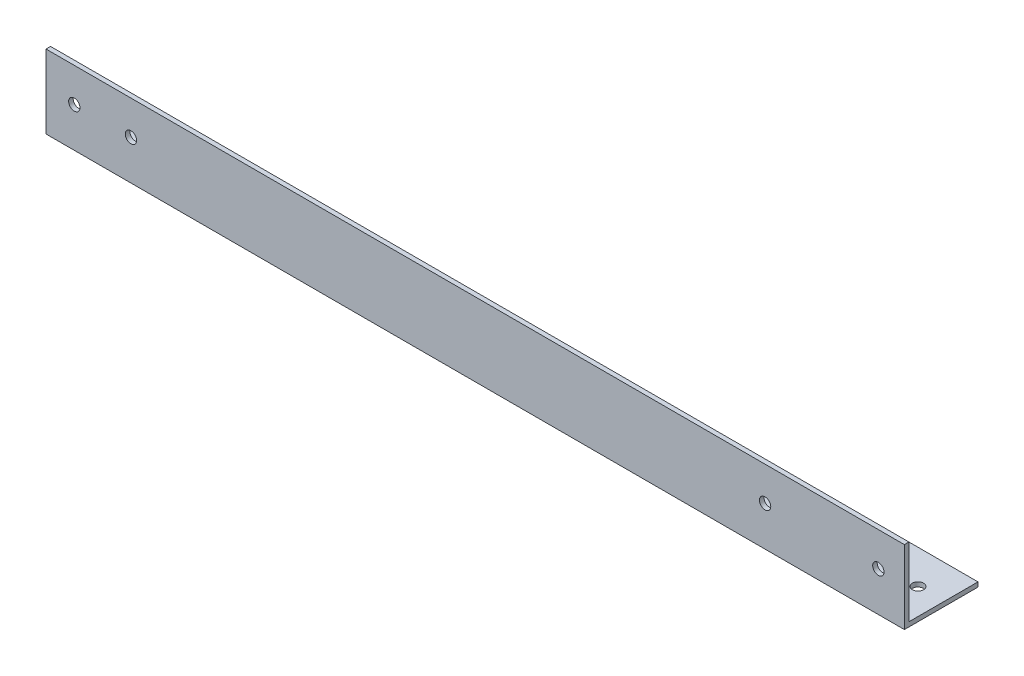
ISO-10303-21;
HEADER;
FILE_DESCRIPTION(('STEP AP214'),'2;1');
FILE_NAME('part.step','',(''),(''),'','','');
FILE_SCHEMA(('AUTOMOTIVE_DESIGN { 1 0 10303 214 1 1 1 1 }'));
ENDSEC;
DATA;
#1=APPLICATION_CONTEXT('core data for automotive mechanical design processes');
#2=APPLICATION_PROTOCOL_DEFINITION('international standard','automotive_design',2000,#1);
#3=PRODUCT_CONTEXT('',#1,'mechanical');
#4=PRODUCT('Part','Part','',(#3));
#5=PRODUCT_RELATED_PRODUCT_CATEGORY('part','',(#4));
#6=PRODUCT_DEFINITION_FORMATION('','',#4);
#7=PRODUCT_DEFINITION_CONTEXT('part definition',#1,'design');
#8=PRODUCT_DEFINITION('design','',#6,#7);
#9=PRODUCT_DEFINITION_SHAPE('','',#8);
#10=(LENGTH_UNIT() NAMED_UNIT(*) SI_UNIT(.MILLI.,.METRE.));
#11=(NAMED_UNIT(*) PLANE_ANGLE_UNIT() SI_UNIT($,.RADIAN.));
#12=(NAMED_UNIT(*) SI_UNIT($,.STERADIAN.) SOLID_ANGLE_UNIT());
#13=UNCERTAINTY_MEASURE_WITH_UNIT(LENGTH_MEASURE(1.E-05),#10,'distance_accuracy_value','');
#14=(GEOMETRIC_REPRESENTATION_CONTEXT(3) GLOBAL_UNCERTAINTY_ASSIGNED_CONTEXT((#13)) GLOBAL_UNIT_ASSIGNED_CONTEXT((#10,
#11,#12)) REPRESENTATION_CONTEXT('',''));
#15=CARTESIAN_POINT('',(0.,0.,0.));
#16=DIRECTION('',(0.,0.,1.));
#17=DIRECTION('',(1.,0.,0.));
#18=AXIS2_PLACEMENT_3D('',#15,#16,#17);
#19=CARTESIAN_POINT('',(758.,0.,0.));
#20=DIRECTION('',(0.,1.,0.));
#21=DIRECTION('',(0.,0.,1.));
#22=AXIS2_PLACEMENT_3D('',#19,#20,#21);
#23=PLANE('',#22);
#24=CARTESIAN_POINT('',(75.,0.,-35.));
#25=DIRECTION('',(0.,-1.,0.));
#26=DIRECTION('',(0.,0.,-1.));
#27=AXIS2_PLACEMENT_3D('',#24,#25,#26);
#28=CIRCLE('',#27,4.99999999999999);
#29=CARTESIAN_POINT('',(75.,0.,-40.));
#30=VERTEX_POINT('',#29);
#31=EDGE_CURVE('E143',#30,#30,#28,.T.);
#32=ORIENTED_EDGE('',*,*,#31,.F.);
#33=EDGE_LOOP('',(#32));
#34=FACE_BOUND('',#33,.T.);
#35=CARTESIAN_POINT('',(735.,0.,-35.));
#36=DIRECTION('',(0.,-1.,0.));
#37=DIRECTION('',(0.,0.,1.));
#38=AXIS2_PLACEMENT_3D('',#35,#36,#37);
#39=CIRCLE('',#38,5.00000000000005);
#40=CARTESIAN_POINT('',(735.,0.,-30.));
#41=VERTEX_POINT('',#40);
#42=EDGE_CURVE('E217',#41,#41,#39,.T.);
#43=ORIENTED_EDGE('',*,*,#42,.F.);
#44=EDGE_LOOP('',(#43));
#45=FACE_BOUND('',#44,.T.);
#46=CARTESIAN_POINT('',(635.,0.,-35.));
#47=DIRECTION('',(0.,-1.,0.));
#48=DIRECTION('',(0.,0.,1.));
#49=AXIS2_PLACEMENT_3D('',#46,#47,#48);
#50=CIRCLE('',#49,5.00000000000005);
#51=CARTESIAN_POINT('',(635.,0.,-30.));
#52=VERTEX_POINT('',#51);
#53=EDGE_CURVE('E156',#52,#52,#50,.T.);
#54=ORIENTED_EDGE('',*,*,#53,.F.);
#55=EDGE_LOOP('',(#54));
#56=FACE_BOUND('',#55,.T.);
#57=CARTESIAN_POINT('',(25.,0.,-35.));
#58=DIRECTION('',(0.,-1.,0.));
#59=DIRECTION('',(0.,0.,-1.));
#60=AXIS2_PLACEMENT_3D('',#57,#58,#59);
#61=CIRCLE('',#60,5.);
#62=CARTESIAN_POINT('',(25.,0.,-40.));
#63=VERTEX_POINT('',#62);
#64=EDGE_CURVE('E139',#63,#63,#61,.T.);
#65=ORIENTED_EDGE('',*,*,#64,.F.);
#66=EDGE_LOOP('',(#65));
#67=FACE_BOUND('',#66,.T.);
#68=DIRECTION('',(0.,0.,-1.));
#69=VECTOR('',#68,1.);
#70=CARTESIAN_POINT('',(0.,0.,0.));
#71=LINE('',#70,#69);
#72=CARTESIAN_POINT('',(0.,0.,0.));
#73=VERTEX_POINT('',#72);
#74=CARTESIAN_POINT('',(0.,0.,-65.));
#75=VERTEX_POINT('',#74);
#76=EDGE_CURVE('E117',#73,#75,#71,.T.);
#77=ORIENTED_EDGE('',*,*,#76,.T.);
#78=DIRECTION('',(-1.,0.,0.));
#79=VECTOR('',#78,1.);
#80=CARTESIAN_POINT('',(758.,0.,-65.));
#81=LINE('',#80,#79);
#82=CARTESIAN_POINT('',(758.,0.,-65.));
#83=VERTEX_POINT('',#82);
#84=EDGE_CURVE('E11',#83,#75,#81,.T.);
#85=ORIENTED_EDGE('',*,*,#84,.F.);
#86=DIRECTION('',(0.,0.,-1.));
#87=VECTOR('',#86,1.);
#88=CARTESIAN_POINT('',(758.,0.,0.));
#89=LINE('',#88,#87);
#90=CARTESIAN_POINT('',(758.,0.,0.));
#91=VERTEX_POINT('',#90);
#92=EDGE_CURVE('E82',#91,#83,#89,.T.);
#93=ORIENTED_EDGE('',*,*,#92,.F.);
#94=DIRECTION('',(-1.,0.,0.));
#95=VECTOR('',#94,1.);
#96=CARTESIAN_POINT('',(758.,0.,0.));
#97=LINE('',#96,#95);
#98=EDGE_CURVE('E113',#91,#73,#97,.T.);
#99=ORIENTED_EDGE('',*,*,#98,.T.);
#100=EDGE_LOOP('',(#77,#85,#93,#99));
#101=FACE_BOUND('',#100,.T.);
#102=ADVANCED_FACE('F34',(#34,#45,#56,#67,#101),#23,.F.);
#103=CARTESIAN_POINT('',(758.,4.,-65.));
#104=DIRECTION('',(0.,0.,-1.));
#105=DIRECTION('',(-1.,0.,0.));
#106=AXIS2_PLACEMENT_3D('',#103,#104,#105);
#107=PLANE('',#106);
#108=DIRECTION('',(0.,-1.,0.));
#109=VECTOR('',#108,1.);
#110=CARTESIAN_POINT('',(0.,4.,-65.));
#111=LINE('',#110,#109);
#112=CARTESIAN_POINT('',(0.,4.,-65.));
#113=VERTEX_POINT('',#112);
#114=EDGE_CURVE('E120',#113,#75,#111,.T.);
#115=ORIENTED_EDGE('',*,*,#114,.F.);
#116=DIRECTION('',(-1.,0.,0.));
#117=VECTOR('',#116,1.);
#118=CARTESIAN_POINT('',(758.,4.,-65.));
#119=LINE('',#118,#117);
#120=CARTESIAN_POINT('',(758.,4.,-65.));
#121=VERTEX_POINT('',#120);
#122=EDGE_CURVE('E43',#121,#113,#119,.T.);
#123=ORIENTED_EDGE('',*,*,#122,.F.);
#124=DIRECTION('',(0.,-1.,0.));
#125=VECTOR('',#124,1.);
#126=CARTESIAN_POINT('',(758.,4.,-65.));
#127=LINE('',#126,#125);
#128=EDGE_CURVE('E181',#121,#83,#127,.T.);
#129=ORIENTED_EDGE('',*,*,#128,.T.);
#130=ORIENTED_EDGE('',*,*,#84,.T.);
#131=EDGE_LOOP('',(#115,#123,#129,#130));
#132=FACE_BOUND('',#131,.T.);
#133=ADVANCED_FACE('F205',(#132),#107,.T.);
#134=CARTESIAN_POINT('',(758.,4.,0.));
#135=DIRECTION('',(0.,1.,0.));
#136=DIRECTION('',(0.,0.,1.));
#137=AXIS2_PLACEMENT_3D('',#134,#135,#136);
#138=PLANE('',#137);
#139=CARTESIAN_POINT('',(75.,4.,-35.));
#140=DIRECTION('',(0.,1.,0.));
#141=DIRECTION('',(0.,0.,1.));
#142=AXIS2_PLACEMENT_3D('',#139,#140,#141);
#143=CIRCLE('',#142,4.99999999999999);
#144=CARTESIAN_POINT('',(75.,4.,-30.));
#145=VERTEX_POINT('',#144);
#146=EDGE_CURVE('E37',#145,#145,#143,.T.);
#147=ORIENTED_EDGE('',*,*,#146,.F.);
#148=EDGE_LOOP('',(#147));
#149=FACE_BOUND('',#148,.T.);
#150=CARTESIAN_POINT('',(735.,4.,-35.));
#151=DIRECTION('',(0.,1.,0.));
#152=DIRECTION('',(0.,0.,1.));
#153=AXIS2_PLACEMENT_3D('',#150,#151,#152);
#154=CIRCLE('',#153,5.00000000000005);
#155=CARTESIAN_POINT('',(735.,4.,-30.));
#156=VERTEX_POINT('',#155);
#157=EDGE_CURVE('E142',#156,#156,#154,.T.);
#158=ORIENTED_EDGE('',*,*,#157,.F.);
#159=EDGE_LOOP('',(#158));
#160=FACE_BOUND('',#159,.T.);
#161=CARTESIAN_POINT('',(635.,4.,-35.));
#162=DIRECTION('',(0.,1.,0.));
#163=DIRECTION('',(0.,0.,1.));
#164=AXIS2_PLACEMENT_3D('',#161,#162,#163);
#165=CIRCLE('',#164,5.00000000000005);
#166=CARTESIAN_POINT('',(635.,4.,-30.));
#167=VERTEX_POINT('',#166);
#168=EDGE_CURVE('E140',#167,#167,#165,.T.);
#169=ORIENTED_EDGE('',*,*,#168,.F.);
#170=EDGE_LOOP('',(#169));
#171=FACE_BOUND('',#170,.T.);
#172=CARTESIAN_POINT('',(25.,4.,-35.));
#173=DIRECTION('',(0.,1.,0.));
#174=DIRECTION('',(0.,0.,1.));
#175=AXIS2_PLACEMENT_3D('',#172,#173,#174);
#176=CIRCLE('',#175,5.);
#177=CARTESIAN_POINT('',(25.,4.,-30.));
#178=VERTEX_POINT('',#177);
#179=EDGE_CURVE('E135',#178,#178,#176,.T.);
#180=ORIENTED_EDGE('',*,*,#179,.F.);
#181=EDGE_LOOP('',(#180));
#182=FACE_BOUND('',#181,.T.);
#183=DIRECTION('',(0.,0.,-1.));
#184=VECTOR('',#183,1.);
#185=CARTESIAN_POINT('',(0.,4.,0.));
#186=LINE('',#185,#184);
#187=CARTESIAN_POINT('',(0.,4.,-4.));
#188=VERTEX_POINT('',#187);
#189=EDGE_CURVE('E124',#188,#113,#186,.T.);
#190=ORIENTED_EDGE('',*,*,#189,.F.);
#191=DIRECTION('',(-1.,0.,0.));
#192=VECTOR('',#191,1.);
#193=CARTESIAN_POINT('',(758.,4.,-4.));
#194=LINE('',#193,#192);
#195=CARTESIAN_POINT('',(758.,4.,-4.));
#196=VERTEX_POINT('',#195);
#197=EDGE_CURVE('E103',#196,#188,#194,.T.);
#198=ORIENTED_EDGE('',*,*,#197,.F.);
#199=DIRECTION('',(0.,0.,-1.));
#200=VECTOR('',#199,1.);
#201=CARTESIAN_POINT('',(758.,4.,0.));
#202=LINE('',#201,#200);
#203=EDGE_CURVE('E109',#196,#121,#202,.T.);
#204=ORIENTED_EDGE('',*,*,#203,.T.);
#205=ORIENTED_EDGE('',*,*,#122,.T.);
#206=EDGE_LOOP('',(#190,#198,#204,#205));
#207=FACE_BOUND('',#206,.T.);
#208=ADVANCED_FACE('F185',(#149,#160,#171,#182,#207),#138,.T.);
#209=CARTESIAN_POINT('',(758.,0.,-4.));
#210=DIRECTION('',(0.,0.,-1.));
#211=DIRECTION('',(-1.,0.,0.));
#212=AXIS2_PLACEMENT_3D('',#209,#210,#211);
#213=PLANE('',#212);
#214=CARTESIAN_POINT('',(75.,35.,-4.));
#215=DIRECTION('',(0.,0.,-1.));
#216=DIRECTION('',(-1.,0.,0.));
#217=AXIS2_PLACEMENT_3D('',#214,#215,#216);
#218=CIRCLE('',#217,5.00000000000001);
#219=CARTESIAN_POINT('',(70.,35.,-4.));
#220=VERTEX_POINT('',#219);
#221=EDGE_CURVE('E172',#220,#220,#218,.T.);
#222=ORIENTED_EDGE('',*,*,#221,.F.);
#223=EDGE_LOOP('',(#222));
#224=FACE_BOUND('',#223,.T.);
#225=CARTESIAN_POINT('',(735.,35.,-4.));
#226=DIRECTION('',(0.,0.,-1.));
#227=DIRECTION('',(-1.,0.,0.));
#228=AXIS2_PLACEMENT_3D('',#225,#226,#227);
#229=CIRCLE('',#228,5.00000000000005);
#230=CARTESIAN_POINT('',(730.,35.,-4.));
#231=VERTEX_POINT('',#230);
#232=EDGE_CURVE('E169',#231,#231,#229,.T.);
#233=ORIENTED_EDGE('',*,*,#232,.F.);
#234=EDGE_LOOP('',(#233));
#235=FACE_BOUND('',#234,.T.);
#236=CARTESIAN_POINT('',(635.,35.,-4.));
#237=DIRECTION('',(0.,0.,-1.));
#238=DIRECTION('',(-1.,0.,0.));
#239=AXIS2_PLACEMENT_3D('',#236,#237,#238);
#240=CIRCLE('',#239,5.00000000000005);
#241=CARTESIAN_POINT('',(630.,35.,-4.));
#242=VERTEX_POINT('',#241);
#243=EDGE_CURVE('E161',#242,#242,#240,.T.);
#244=ORIENTED_EDGE('',*,*,#243,.F.);
#245=EDGE_LOOP('',(#244));
#246=FACE_BOUND('',#245,.T.);
#247=CARTESIAN_POINT('',(25.,35.,-4.));
#248=DIRECTION('',(0.,0.,-1.));
#249=DIRECTION('',(-1.,0.,0.));
#250=AXIS2_PLACEMENT_3D('',#247,#248,#249);
#251=CIRCLE('',#250,5.);
#252=CARTESIAN_POINT('',(20.,35.,-4.));
#253=VERTEX_POINT('',#252);
#254=EDGE_CURVE('E121',#253,#253,#251,.T.);
#255=ORIENTED_EDGE('',*,*,#254,.F.);
#256=EDGE_LOOP('',(#255));
#257=FACE_BOUND('',#256,.T.);
#258=DIRECTION('',(0.,1.,0.));
#259=VECTOR('',#258,1.);
#260=CARTESIAN_POINT('',(0.,0.,-4.));
#261=LINE('',#260,#259);
#262=CARTESIAN_POINT('',(0.,65.,-4.));
#263=VERTEX_POINT('',#262);
#264=EDGE_CURVE('E98',#263,#188,#261,.F.);
#265=ORIENTED_EDGE('',*,*,#264,.F.);
#266=DIRECTION('',(-1.,0.,0.));
#267=VECTOR('',#266,1.);
#268=CARTESIAN_POINT('',(758.,65.,-4.));
#269=LINE('',#268,#267);
#270=CARTESIAN_POINT('',(758.,65.,-4.));
#271=VERTEX_POINT('',#270);
#272=EDGE_CURVE('E93',#271,#263,#269,.T.);
#273=ORIENTED_EDGE('',*,*,#272,.F.);
#274=DIRECTION('',(0.,1.,0.));
#275=VECTOR('',#274,1.);
#276=CARTESIAN_POINT('',(758.,0.,-4.));
#277=LINE('',#276,#275);
#278=EDGE_CURVE('E96',#271,#196,#277,.F.);
#279=ORIENTED_EDGE('',*,*,#278,.T.);
#280=ORIENTED_EDGE('',*,*,#197,.T.);
#281=EDGE_LOOP('',(#265,#273,#279,#280));
#282=FACE_BOUND('',#281,.T.);
#283=ADVANCED_FACE('F95',(#224,#235,#246,#257,#282),#213,.T.);
#284=CARTESIAN_POINT('',(758.,65.,0.));
#285=DIRECTION('',(0.,1.,0.));
#286=DIRECTION('',(0.,0.,1.));
#287=AXIS2_PLACEMENT_3D('',#284,#285,#286);
#288=PLANE('',#287);
#289=DIRECTION('',(0.,0.,-1.));
#290=VECTOR('',#289,1.);
#291=CARTESIAN_POINT('',(0.,65.,0.));
#292=LINE('',#291,#290);
#293=CARTESIAN_POINT('',(0.,65.,0.));
#294=VERTEX_POINT('',#293);
#295=EDGE_CURVE('E128',#294,#263,#292,.T.);
#296=ORIENTED_EDGE('',*,*,#295,.F.);
#297=DIRECTION('',(-1.,0.,0.));
#298=VECTOR('',#297,1.);
#299=CARTESIAN_POINT('',(758.,65.,0.));
#300=LINE('',#299,#298);
#301=CARTESIAN_POINT('',(758.,65.,0.));
#302=VERTEX_POINT('',#301);
#303=EDGE_CURVE('E73',#302,#294,#300,.T.);
#304=ORIENTED_EDGE('',*,*,#303,.F.);
#305=DIRECTION('',(0.,0.,-1.));
#306=VECTOR('',#305,1.);
#307=CARTESIAN_POINT('',(758.,65.,0.));
#308=LINE('',#307,#306);
#309=EDGE_CURVE('E107',#302,#271,#308,.T.);
#310=ORIENTED_EDGE('',*,*,#309,.T.);
#311=ORIENTED_EDGE('',*,*,#272,.T.);
#312=EDGE_LOOP('',(#296,#304,#310,#311));
#313=FACE_BOUND('',#312,.T.);
#314=ADVANCED_FACE('F111',(#313),#288,.T.);
#315=CARTESIAN_POINT('',(758.,0.,0.));
#316=DIRECTION('',(0.,0.,-1.));
#317=DIRECTION('',(-1.,0.,0.));
#318=AXIS2_PLACEMENT_3D('',#315,#316,#317);
#319=PLANE('',#318);
#320=CARTESIAN_POINT('',(75.,35.,0.));
#321=DIRECTION('',(0.,0.,1.));
#322=DIRECTION('',(1.,0.,0.));
#323=AXIS2_PLACEMENT_3D('',#320,#321,#322);
#324=CIRCLE('',#323,5.00000000000001);
#325=CARTESIAN_POINT('',(80.,35.,0.));
#326=VERTEX_POINT('',#325);
#327=EDGE_CURVE('E158',#326,#326,#324,.T.);
#328=ORIENTED_EDGE('',*,*,#327,.F.);
#329=EDGE_LOOP('',(#328));
#330=FACE_BOUND('',#329,.T.);
#331=CARTESIAN_POINT('',(735.,35.,0.));
#332=DIRECTION('',(0.,0.,1.));
#333=DIRECTION('',(-1.,0.,0.));
#334=AXIS2_PLACEMENT_3D('',#331,#332,#333);
#335=CIRCLE('',#334,5.00000000000005);
#336=CARTESIAN_POINT('',(730.,35.,0.));
#337=VERTEX_POINT('',#336);
#338=EDGE_CURVE('E162',#337,#337,#335,.T.);
#339=ORIENTED_EDGE('',*,*,#338,.F.);
#340=EDGE_LOOP('',(#339));
#341=FACE_BOUND('',#340,.T.);
#342=CARTESIAN_POINT('',(635.,35.,0.));
#343=DIRECTION('',(0.,0.,1.));
#344=DIRECTION('',(-1.,0.,0.));
#345=AXIS2_PLACEMENT_3D('',#342,#343,#344);
#346=CIRCLE('',#345,5.00000000000005);
#347=CARTESIAN_POINT('',(630.,35.,0.));
#348=VERTEX_POINT('',#347);
#349=EDGE_CURVE('E138',#348,#348,#346,.T.);
#350=ORIENTED_EDGE('',*,*,#349,.F.);
#351=EDGE_LOOP('',(#350));
#352=FACE_BOUND('',#351,.T.);
#353=CARTESIAN_POINT('',(25.,35.,0.));
#354=DIRECTION('',(0.,0.,1.));
#355=DIRECTION('',(1.,0.,0.));
#356=AXIS2_PLACEMENT_3D('',#353,#354,#355);
#357=CIRCLE('',#356,5.);
#358=CARTESIAN_POINT('',(30.,35.,0.));
#359=VERTEX_POINT('',#358);
#360=EDGE_CURVE('E175',#359,#359,#357,.T.);
#361=ORIENTED_EDGE('',*,*,#360,.F.);
#362=EDGE_LOOP('',(#361));
#363=FACE_BOUND('',#362,.T.);
#364=DIRECTION('',(0.,-1.,0.));
#365=VECTOR('',#364,1.);
#366=CARTESIAN_POINT('',(0.,0.,0.));
#367=LINE('',#366,#365);
#368=EDGE_CURVE('E76',#294,#73,#367,.T.);
#369=ORIENTED_EDGE('',*,*,#368,.T.);
#370=ORIENTED_EDGE('',*,*,#98,.F.);
#371=DIRECTION('',(0.,-1.,0.));
#372=VECTOR('',#371,1.);
#373=CARTESIAN_POINT('',(758.,0.,0.));
#374=LINE('',#373,#372);
#375=EDGE_CURVE('E52',#302,#91,#374,.T.);
#376=ORIENTED_EDGE('',*,*,#375,.F.);
#377=ORIENTED_EDGE('',*,*,#303,.T.);
#378=EDGE_LOOP('',(#369,#370,#376,#377));
#379=FACE_BOUND('',#378,.T.);
#380=ADVANCED_FACE('F191',(#330,#341,#352,#363,#379),#319,.F.);
#381=CARTESIAN_POINT('',(758.,0.,0.));
#382=DIRECTION('',(-1.,0.,0.));
#383=DIRECTION('',(0.,0.,1.));
#384=AXIS2_PLACEMENT_3D('',#381,#382,#383);
#385=PLANE('',#384);
#386=ORIENTED_EDGE('',*,*,#92,.T.);
#387=ORIENTED_EDGE('',*,*,#128,.F.);
#388=ORIENTED_EDGE('',*,*,#203,.F.);
#389=ORIENTED_EDGE('',*,*,#278,.F.);
#390=ORIENTED_EDGE('',*,*,#309,.F.);
#391=ORIENTED_EDGE('',*,*,#375,.T.);
#392=EDGE_LOOP('',(#386,#387,#388,#389,#390,#391));
#393=FACE_BOUND('',#392,.T.);
#394=ADVANCED_FACE('F106',(#393),#385,.F.);
#395=CARTESIAN_POINT('',(0.,0.,0.));
#396=DIRECTION('',(-1.,0.,0.));
#397=DIRECTION('',(0.,0.,1.));
#398=AXIS2_PLACEMENT_3D('',#395,#396,#397);
#399=PLANE('',#398);
#400=ORIENTED_EDGE('',*,*,#76,.F.);
#401=ORIENTED_EDGE('',*,*,#368,.F.);
#402=ORIENTED_EDGE('',*,*,#295,.T.);
#403=ORIENTED_EDGE('',*,*,#264,.T.);
#404=ORIENTED_EDGE('',*,*,#189,.T.);
#405=ORIENTED_EDGE('',*,*,#114,.T.);
#406=EDGE_LOOP('',(#400,#401,#402,#403,#404,#405));
#407=FACE_BOUND('',#406,.T.);
#408=ADVANCED_FACE('F189',(#407),#399,.T.);
#409=CARTESIAN_POINT('',(25.,35.,-10.));
#410=DIRECTION('',(0.,0.,1.));
#411=DIRECTION('',(1.,0.,0.));
#412=AXIS2_PLACEMENT_3D('',#409,#410,#411);
#413=CYLINDRICAL_SURFACE('',#412,5.);
#414=ORIENTED_EDGE('',*,*,#254,.T.);
#415=EDGE_LOOP('',(#414));
#416=FACE_BOUND('',#415,.T.);
#417=ORIENTED_EDGE('',*,*,#360,.T.);
#418=EDGE_LOOP('',(#417));
#419=FACE_BOUND('',#418,.T.);
#420=ADVANCED_FACE('F253',(#416,#419),#413,.F.);
#421=CARTESIAN_POINT('',(635.,35.,-10.));
#422=DIRECTION('',(0.,0.,1.));
#423=DIRECTION('',(1.,0.,0.));
#424=AXIS2_PLACEMENT_3D('',#421,#422,#423);
#425=CYLINDRICAL_SURFACE('',#424,5.00000000000005);
#426=ORIENTED_EDGE('',*,*,#243,.T.);
#427=EDGE_LOOP('',(#426));
#428=FACE_BOUND('',#427,.T.);
#429=ORIENTED_EDGE('',*,*,#349,.T.);
#430=EDGE_LOOP('',(#429));
#431=FACE_BOUND('',#430,.T.);
#432=ADVANCED_FACE('F249',(#428,#431),#425,.F.);
#433=CARTESIAN_POINT('',(735.,35.,-10.));
#434=DIRECTION('',(0.,0.,1.));
#435=DIRECTION('',(1.,0.,0.));
#436=AXIS2_PLACEMENT_3D('',#433,#434,#435);
#437=CYLINDRICAL_SURFACE('',#436,5.00000000000005);
#438=ORIENTED_EDGE('',*,*,#232,.T.);
#439=EDGE_LOOP('',(#438));
#440=FACE_BOUND('',#439,.T.);
#441=ORIENTED_EDGE('',*,*,#338,.T.);
#442=EDGE_LOOP('',(#441));
#443=FACE_BOUND('',#442,.T.);
#444=ADVANCED_FACE('F245',(#440,#443),#437,.F.);
#445=CARTESIAN_POINT('',(75.,35.,-10.));
#446=DIRECTION('',(0.,0.,1.));
#447=DIRECTION('',(1.,0.,0.));
#448=AXIS2_PLACEMENT_3D('',#445,#446,#447);
#449=CYLINDRICAL_SURFACE('',#448,5.00000000000001);
#450=ORIENTED_EDGE('',*,*,#221,.T.);
#451=EDGE_LOOP('',(#450));
#452=FACE_BOUND('',#451,.T.);
#453=ORIENTED_EDGE('',*,*,#327,.T.);
#454=EDGE_LOOP('',(#453));
#455=FACE_BOUND('',#454,.T.);
#456=ADVANCED_FACE('F241',(#452,#455),#449,.F.);
#457=CARTESIAN_POINT('',(25.,10.,-35.));
#458=DIRECTION('',(0.,-1.,0.));
#459=DIRECTION('',(0.,0.,-1.));
#460=AXIS2_PLACEMENT_3D('',#457,#458,#459);
#461=CYLINDRICAL_SURFACE('',#460,5.);
#462=ORIENTED_EDGE('',*,*,#179,.T.);
#463=EDGE_LOOP('',(#462));
#464=FACE_BOUND('',#463,.T.);
#465=ORIENTED_EDGE('',*,*,#64,.T.);
#466=EDGE_LOOP('',(#465));
#467=FACE_BOUND('',#466,.T.);
#468=ADVANCED_FACE('F237',(#464,#467),#461,.F.);
#469=CARTESIAN_POINT('',(635.,10.,-35.));
#470=DIRECTION('',(0.,-1.,0.));
#471=DIRECTION('',(0.,0.,-1.));
#472=AXIS2_PLACEMENT_3D('',#469,#470,#471);
#473=CYLINDRICAL_SURFACE('',#472,5.00000000000005);
#474=ORIENTED_EDGE('',*,*,#168,.T.);
#475=EDGE_LOOP('',(#474));
#476=FACE_BOUND('',#475,.T.);
#477=ORIENTED_EDGE('',*,*,#53,.T.);
#478=EDGE_LOOP('',(#477));
#479=FACE_BOUND('',#478,.T.);
#480=ADVANCED_FACE('F232',(#476,#479),#473,.F.);
#481=CARTESIAN_POINT('',(735.,10.,-35.));
#482=DIRECTION('',(0.,-1.,0.));
#483=DIRECTION('',(0.,0.,-1.));
#484=AXIS2_PLACEMENT_3D('',#481,#482,#483);
#485=CYLINDRICAL_SURFACE('',#484,5.00000000000005);
#486=ORIENTED_EDGE('',*,*,#157,.T.);
#487=EDGE_LOOP('',(#486));
#488=FACE_BOUND('',#487,.T.);
#489=ORIENTED_EDGE('',*,*,#42,.T.);
#490=EDGE_LOOP('',(#489));
#491=FACE_BOUND('',#490,.T.);
#492=ADVANCED_FACE('F227',(#488,#491),#485,.F.);
#493=CARTESIAN_POINT('',(75.,10.,-35.));
#494=DIRECTION('',(0.,-1.,0.));
#495=DIRECTION('',(0.,0.,-1.));
#496=AXIS2_PLACEMENT_3D('',#493,#494,#495);
#497=CYLINDRICAL_SURFACE('',#496,4.99999999999999);
#498=ORIENTED_EDGE('',*,*,#146,.T.);
#499=EDGE_LOOP('',(#498));
#500=FACE_BOUND('',#499,.T.);
#501=ORIENTED_EDGE('',*,*,#31,.T.);
#502=EDGE_LOOP('',(#501));
#503=FACE_BOUND('',#502,.T.);
#504=ADVANCED_FACE('F225',(#500,#503),#497,.F.);
#505=CLOSED_SHELL('',(#102,#133,#208,#283,#314,#380,#394,#408,#420,#432,#444,#456,#468,#480,
#492,#504));
#506=MANIFOLD_SOLID_BREP('B2',#505);
#507=ADVANCED_BREP_SHAPE_REPRESENTATION('',(#18,#506),#14);
#508=SHAPE_DEFINITION_REPRESENTATION(#9,#507);
ENDSEC;
END-ISO-10303-21;
